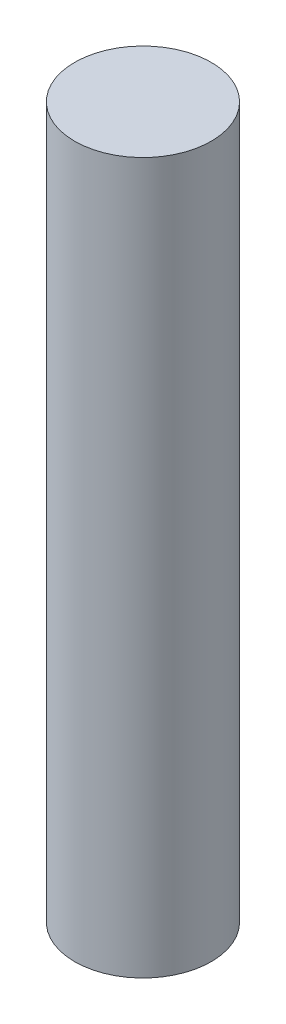
ISO-10303-21;
HEADER;
FILE_DESCRIPTION(('STEP AP214'),'2;1');
FILE_NAME('part.step','',(''),(''),'','','');
FILE_SCHEMA(('AUTOMOTIVE_DESIGN { 1 0 10303 214 1 1 1 1 }'));
ENDSEC;
DATA;
#1=APPLICATION_CONTEXT('core data for automotive mechanical design processes');
#2=APPLICATION_PROTOCOL_DEFINITION('international standard','automotive_design',2000,#1);
#3=PRODUCT_CONTEXT('',#1,'mechanical');
#4=PRODUCT('Part','Part','',(#3));
#5=PRODUCT_RELATED_PRODUCT_CATEGORY('part','',(#4));
#6=PRODUCT_DEFINITION_FORMATION('','',#4);
#7=PRODUCT_DEFINITION_CONTEXT('part definition',#1,'design');
#8=PRODUCT_DEFINITION('design','',#6,#7);
#9=PRODUCT_DEFINITION_SHAPE('','',#8);
#10=(LENGTH_UNIT() NAMED_UNIT(*) SI_UNIT(.MILLI.,.METRE.));
#11=(NAMED_UNIT(*) PLANE_ANGLE_UNIT() SI_UNIT($,.RADIAN.));
#12=(NAMED_UNIT(*) SI_UNIT($,.STERADIAN.) SOLID_ANGLE_UNIT());
#13=UNCERTAINTY_MEASURE_WITH_UNIT(LENGTH_MEASURE(1.E-05),#10,'distance_accuracy_value','');
#14=(GEOMETRIC_REPRESENTATION_CONTEXT(3) GLOBAL_UNCERTAINTY_ASSIGNED_CONTEXT((#13)) GLOBAL_UNIT_ASSIGNED_CONTEXT((#10,
#11,#12)) REPRESENTATION_CONTEXT('',''));
#15=CARTESIAN_POINT('',(0.,0.,0.));
#16=DIRECTION('',(0.,0.,1.));
#17=DIRECTION('',(1.,0.,0.));
#18=AXIS2_PLACEMENT_3D('',#15,#16,#17);
#19=CARTESIAN_POINT('',(0.,13.,0.));
#20=DIRECTION('',(0.,-1.,0.));
#21=DIRECTION('',(0.,0.,-1.));
#22=AXIS2_PLACEMENT_3D('',#19,#20,#21);
#23=CYLINDRICAL_SURFACE('',#22,1.25);
#24=CARTESIAN_POINT('',(0.,13.,0.));
#25=DIRECTION('',(0.,1.,0.));
#26=DIRECTION('',(0.,0.,1.));
#27=AXIS2_PLACEMENT_3D('',#24,#25,#26);
#28=CIRCLE('',#27,1.25);
#29=CARTESIAN_POINT('',(0.,13.,1.25));
#30=VERTEX_POINT('',#29);
#31=EDGE_CURVE('E10',#30,#30,#28,.T.);
#32=ORIENTED_EDGE('',*,*,#31,.F.);
#33=EDGE_LOOP('',(#32));
#34=FACE_BOUND('',#33,.T.);
#35=CARTESIAN_POINT('',(0.,0.,0.));
#36=DIRECTION('',(0.,1.,0.));
#37=DIRECTION('',(0.,0.,1.));
#38=AXIS2_PLACEMENT_3D('',#35,#36,#37);
#39=CIRCLE('',#38,1.25);
#40=CARTESIAN_POINT('',(0.,0.,1.25));
#41=VERTEX_POINT('',#40);
#42=EDGE_CURVE('E46',#41,#41,#39,.T.);
#43=ORIENTED_EDGE('',*,*,#42,.T.);
#44=EDGE_LOOP('',(#43));
#45=FACE_BOUND('',#44,.T.);
#46=ADVANCED_FACE('F43',(#34,#45),#23,.T.);
#47=CARTESIAN_POINT('',(0.,13.,0.));
#48=DIRECTION('',(0.,1.,0.));
#49=DIRECTION('',(0.,0.,1.));
#50=AXIS2_PLACEMENT_3D('',#47,#48,#49);
#51=PLANE('',#50);
#52=ORIENTED_EDGE('',*,*,#31,.T.);
#53=EDGE_LOOP('',(#52));
#54=FACE_BOUND('',#53,.T.);
#55=ADVANCED_FACE('F60',(#54),#51,.T.);
#56=CARTESIAN_POINT('',(0.,0.,0.));
#57=DIRECTION('',(0.,1.,0.));
#58=DIRECTION('',(0.,0.,1.));
#59=AXIS2_PLACEMENT_3D('',#56,#57,#58);
#60=PLANE('',#59);
#61=ORIENTED_EDGE('',*,*,#42,.F.);
#62=EDGE_LOOP('',(#61));
#63=FACE_BOUND('',#62,.T.);
#64=ADVANCED_FACE('F58',(#63),#60,.F.);
#65=CLOSED_SHELL('',(#46,#55,#64));
#66=MANIFOLD_SOLID_BREP('B2',#65);
#67=ADVANCED_BREP_SHAPE_REPRESENTATION('',(#18,#66),#14);
#68=SHAPE_DEFINITION_REPRESENTATION(#9,#67);
ENDSEC;
END-ISO-10303-21;
